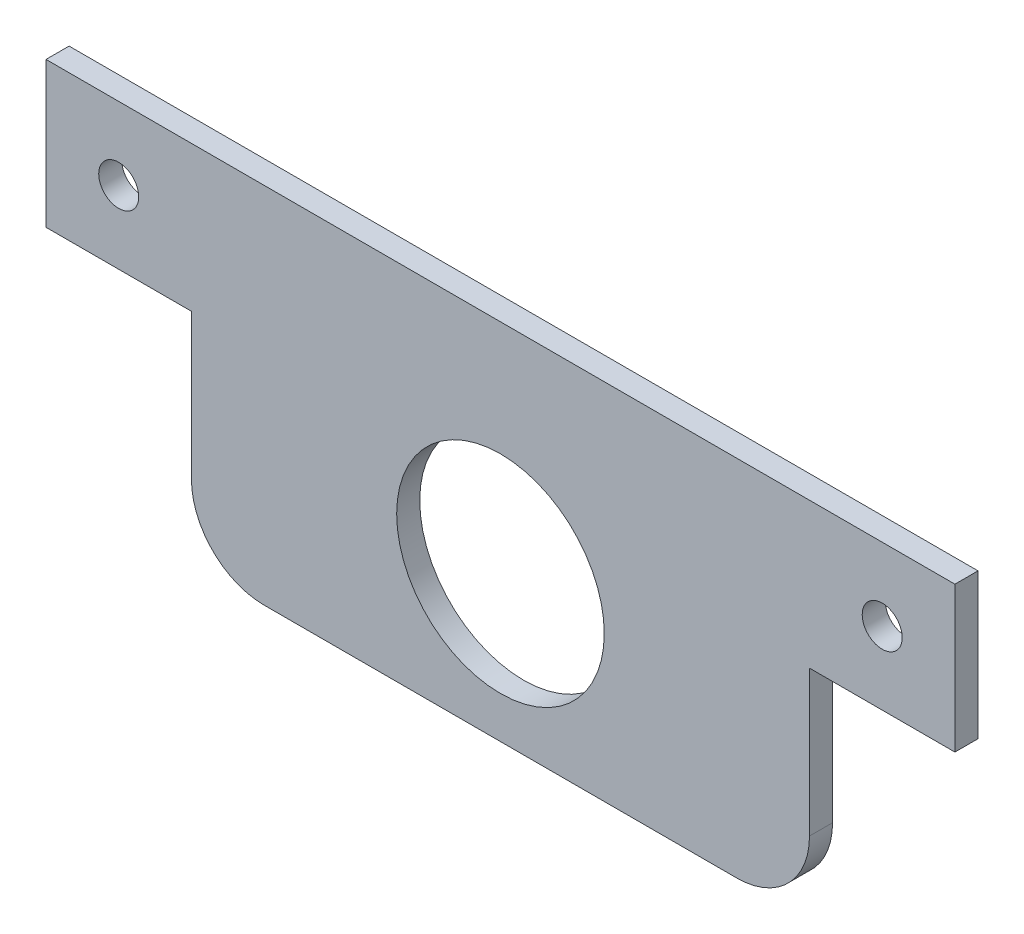
ISO-10303-21;
HEADER;
FILE_DESCRIPTION(('STEP AP214'),'2;1');
FILE_NAME('part.step','',(''),(''),'','','');
FILE_SCHEMA(('AUTOMOTIVE_DESIGN { 1 0 10303 214 1 1 1 1 }'));
ENDSEC;
DATA;
#1=APPLICATION_CONTEXT('core data for automotive mechanical design processes');
#2=APPLICATION_PROTOCOL_DEFINITION('international standard','automotive_design',2000,#1);
#3=PRODUCT_CONTEXT('',#1,'mechanical');
#4=PRODUCT('Part','Part','',(#3));
#5=PRODUCT_RELATED_PRODUCT_CATEGORY('part','',(#4));
#6=PRODUCT_DEFINITION_FORMATION('','',#4);
#7=PRODUCT_DEFINITION_CONTEXT('part definition',#1,'design');
#8=PRODUCT_DEFINITION('design','',#6,#7);
#9=PRODUCT_DEFINITION_SHAPE('','',#8);
#10=(LENGTH_UNIT() NAMED_UNIT(*) SI_UNIT(.MILLI.,.METRE.));
#11=(NAMED_UNIT(*) PLANE_ANGLE_UNIT() SI_UNIT($,.RADIAN.));
#12=(NAMED_UNIT(*) SI_UNIT($,.STERADIAN.) SOLID_ANGLE_UNIT());
#13=UNCERTAINTY_MEASURE_WITH_UNIT(LENGTH_MEASURE(1.E-05),#10,'distance_accuracy_value','');
#14=(GEOMETRIC_REPRESENTATION_CONTEXT(3) GLOBAL_UNCERTAINTY_ASSIGNED_CONTEXT((#13)) GLOBAL_UNIT_ASSIGNED_CONTEXT((#10,
#11,#12)) REPRESENTATION_CONTEXT('',''));
#15=CARTESIAN_POINT('',(0.,0.,0.));
#16=DIRECTION('',(0.,0.,1.));
#17=DIRECTION('',(1.,0.,0.));
#18=AXIS2_PLACEMENT_3D('',#15,#16,#17);
#19=CARTESIAN_POINT('',(0.,0.,3.175));
#20=DIRECTION('',(1.,0.,0.));
#21=DIRECTION('',(0.,0.,-1.));
#22=AXIS2_PLACEMENT_3D('',#19,#20,#21);
#23=PLANE('',#22);
#24=DIRECTION('',(0.,-1.,0.));
#25=VECTOR('',#24,1.);
#26=CARTESIAN_POINT('',(0.,0.,0.));
#27=LINE('',#26,#25);
#28=CARTESIAN_POINT('',(0.,50.,0.));
#29=VERTEX_POINT('',#28);
#30=CARTESIAN_POINT('',(0.,30.,0.));
#31=VERTEX_POINT('',#30);
#32=EDGE_CURVE('E171',#29,#31,#27,.T.);
#33=ORIENTED_EDGE('',*,*,#32,.T.);
#34=DIRECTION('',(0.,0.,-1.));
#35=VECTOR('',#34,1.);
#36=CARTESIAN_POINT('',(0.,30.,3.175));
#37=LINE('',#36,#35);
#38=CARTESIAN_POINT('',(0.,30.,3.175));
#39=VERTEX_POINT('',#38);
#40=EDGE_CURVE('E124',#39,#31,#37,.T.);
#41=ORIENTED_EDGE('',*,*,#40,.F.);
#42=DIRECTION('',(0.,-1.,0.));
#43=VECTOR('',#42,1.);
#44=CARTESIAN_POINT('',(0.,0.,3.175));
#45=LINE('',#44,#43);
#46=CARTESIAN_POINT('',(0.,50.,3.175));
#47=VERTEX_POINT('',#46);
#48=EDGE_CURVE('E174',#47,#39,#45,.T.);
#49=ORIENTED_EDGE('',*,*,#48,.F.);
#50=DIRECTION('',(0.,0.,-1.));
#51=VECTOR('',#50,1.);
#52=CARTESIAN_POINT('',(0.,50.,3.175));
#53=LINE('',#52,#51);
#54=EDGE_CURVE('E184',#47,#29,#53,.T.);
#55=ORIENTED_EDGE('',*,*,#54,.T.);
#56=EDGE_LOOP('',(#33,#41,#49,#55));
#57=FACE_BOUND('',#56,.T.);
#58=ADVANCED_FACE('F39',(#57),#23,.F.);
#59=CARTESIAN_POINT('',(0.,0.,3.175));
#60=DIRECTION('',(0.,1.,0.));
#61=DIRECTION('',(0.,0.,1.));
#62=AXIS2_PLACEMENT_3D('',#59,#60,#61);
#63=PLANE('',#62);
#64=DIRECTION('',(1.,0.,0.));
#65=VECTOR('',#64,1.);
#66=CARTESIAN_POINT('',(0.,0.,3.175));
#67=LINE('',#66,#65);
#68=CARTESIAN_POINT('',(30.,0.,3.175));
#69=VERTEX_POINT('',#68);
#70=CARTESIAN_POINT('',(95.,0.,3.175));
#71=VERTEX_POINT('',#70);
#72=EDGE_CURVE('E177',#69,#71,#67,.T.);
#73=ORIENTED_EDGE('',*,*,#72,.F.);
#74=DIRECTION('',(0.,0.,-1.));
#75=VECTOR('',#74,1.);
#76=CARTESIAN_POINT('',(30.,0.,3.175));
#77=LINE('',#76,#75);
#78=CARTESIAN_POINT('',(30.,0.,0.));
#79=VERTEX_POINT('',#78);
#80=EDGE_CURVE('E199',#69,#79,#77,.T.);
#81=ORIENTED_EDGE('',*,*,#80,.T.);
#82=DIRECTION('',(1.,0.,0.));
#83=VECTOR('',#82,1.);
#84=CARTESIAN_POINT('',(0.,0.,0.));
#85=LINE('',#84,#83);
#86=CARTESIAN_POINT('',(95.,0.,0.));
#87=VERTEX_POINT('',#86);
#88=EDGE_CURVE('E186',#79,#87,#85,.T.);
#89=ORIENTED_EDGE('',*,*,#88,.T.);
#90=DIRECTION('',(0.,0.,-1.));
#91=VECTOR('',#90,1.);
#92=CARTESIAN_POINT('',(95.,0.,3.175));
#93=LINE('',#92,#91);
#94=EDGE_CURVE('E197',#87,#71,#93,.F.);
#95=ORIENTED_EDGE('',*,*,#94,.T.);
#96=EDGE_LOOP('',(#73,#81,#89,#95));
#97=FACE_BOUND('',#96,.T.);
#98=ADVANCED_FACE('F212',(#97),#63,.F.);
#99=CARTESIAN_POINT('',(125.,0.,3.175));
#100=DIRECTION('',(-1.,0.,0.));
#101=DIRECTION('',(0.,0.,1.));
#102=AXIS2_PLACEMENT_3D('',#99,#100,#101);
#103=PLANE('',#102);
#104=DIRECTION('',(0.,1.,0.));
#105=VECTOR('',#104,1.);
#106=CARTESIAN_POINT('',(125.,0.,3.175));
#107=LINE('',#106,#105);
#108=CARTESIAN_POINT('',(125.,30.,3.175));
#109=VERTEX_POINT('',#108);
#110=CARTESIAN_POINT('',(125.,50.,3.175));
#111=VERTEX_POINT('',#110);
#112=EDGE_CURVE('E180',#109,#111,#107,.T.);
#113=ORIENTED_EDGE('',*,*,#112,.F.);
#114=DIRECTION('',(0.,0.,-1.));
#115=VECTOR('',#114,1.);
#116=CARTESIAN_POINT('',(125.,30.,3.175));
#117=LINE('',#116,#115);
#118=CARTESIAN_POINT('',(125.,30.,0.));
#119=VERTEX_POINT('',#118);
#120=EDGE_CURVE('E150',#109,#119,#117,.T.);
#121=ORIENTED_EDGE('',*,*,#120,.T.);
#122=DIRECTION('',(0.,1.,0.));
#123=VECTOR('',#122,1.);
#124=CARTESIAN_POINT('',(125.,0.,0.));
#125=LINE('',#124,#123);
#126=CARTESIAN_POINT('',(125.,50.,0.));
#127=VERTEX_POINT('',#126);
#128=EDGE_CURVE('E189',#119,#127,#125,.T.);
#129=ORIENTED_EDGE('',*,*,#128,.T.);
#130=DIRECTION('',(0.,0.,-1.));
#131=VECTOR('',#130,1.);
#132=CARTESIAN_POINT('',(125.,50.,3.175));
#133=LINE('',#132,#131);
#134=EDGE_CURVE('E194',#111,#127,#133,.T.);
#135=ORIENTED_EDGE('',*,*,#134,.F.);
#136=EDGE_LOOP('',(#113,#121,#129,#135));
#137=FACE_BOUND('',#136,.T.);
#138=ADVANCED_FACE('F233',(#137),#103,.F.);
#139=CARTESIAN_POINT('',(0.,50.,3.175));
#140=DIRECTION('',(0.,-1.,0.));
#141=DIRECTION('',(0.,0.,-1.));
#142=AXIS2_PLACEMENT_3D('',#139,#140,#141);
#143=PLANE('',#142);
#144=DIRECTION('',(-1.,0.,0.));
#145=VECTOR('',#144,1.);
#146=CARTESIAN_POINT('',(0.,50.,0.));
#147=LINE('',#146,#145);
#148=EDGE_CURVE('E178',#127,#29,#147,.T.);
#149=ORIENTED_EDGE('',*,*,#148,.T.);
#150=ORIENTED_EDGE('',*,*,#54,.F.);
#151=DIRECTION('',(-1.,0.,0.));
#152=VECTOR('',#151,1.);
#153=CARTESIAN_POINT('',(0.,50.,3.175));
#154=LINE('',#153,#152);
#155=EDGE_CURVE('E182',#111,#47,#154,.T.);
#156=ORIENTED_EDGE('',*,*,#155,.F.);
#157=ORIENTED_EDGE('',*,*,#134,.T.);
#158=EDGE_LOOP('',(#149,#150,#156,#157));
#159=FACE_BOUND('',#158,.T.);
#160=ADVANCED_FACE('F237',(#159),#143,.F.);
#161=CARTESIAN_POINT('',(0.,0.,3.175));
#162=DIRECTION('',(0.,0.,-1.));
#163=DIRECTION('',(-1.,0.,0.));
#164=AXIS2_PLACEMENT_3D('',#161,#162,#163);
#165=PLANE('',#164);
#166=CARTESIAN_POINT('',(10.,40.,3.175));
#167=DIRECTION('',(0.,0.,-1.));
#168=DIRECTION('',(-1.,0.,0.));
#169=AXIS2_PLACEMENT_3D('',#166,#167,#168);
#170=CIRCLE('',#169,2.75);
#171=CARTESIAN_POINT('',(7.25,40.,3.175));
#172=VERTEX_POINT('',#171);
#173=EDGE_CURVE('E134',#172,#172,#170,.T.);
#174=ORIENTED_EDGE('',*,*,#173,.T.);
#175=EDGE_LOOP('',(#174));
#176=FACE_BOUND('',#175,.T.);
#177=CARTESIAN_POINT('',(115.,40.,3.175));
#178=DIRECTION('',(0.,0.,-1.));
#179=DIRECTION('',(-1.,0.,0.));
#180=AXIS2_PLACEMENT_3D('',#177,#178,#179);
#181=CIRCLE('',#180,2.75000000000001);
#182=CARTESIAN_POINT('',(112.25,40.,3.175));
#183=VERTEX_POINT('',#182);
#184=EDGE_CURVE('E160',#183,#183,#181,.T.);
#185=ORIENTED_EDGE('',*,*,#184,.T.);
#186=EDGE_LOOP('',(#185));
#187=FACE_BOUND('',#186,.T.);
#188=CARTESIAN_POINT('',(62.5,20.,3.175));
#189=DIRECTION('',(0.,0.,1.));
#190=DIRECTION('',(1.,0.,0.));
#191=AXIS2_PLACEMENT_3D('',#188,#189,#190);
#192=CIRCLE('',#191,14.275);
#193=CARTESIAN_POINT('',(76.775,20.,3.175));
#194=VERTEX_POINT('',#193);
#195=EDGE_CURVE('E163',#194,#194,#192,.T.);
#196=ORIENTED_EDGE('',*,*,#195,.F.);
#197=EDGE_LOOP('',(#196));
#198=FACE_BOUND('',#197,.T.);
#199=DIRECTION('',(0.,-1.,0.));
#200=VECTOR('',#199,1.);
#201=CARTESIAN_POINT('',(20.,0.,3.175));
#202=LINE('',#201,#200);
#203=CARTESIAN_POINT('',(20.,30.,3.175));
#204=VERTEX_POINT('',#203);
#205=CARTESIAN_POINT('',(20.,10.,3.175));
#206=VERTEX_POINT('',#205);
#207=EDGE_CURVE('E121',#204,#206,#202,.T.);
#208=ORIENTED_EDGE('',*,*,#207,.T.);
#209=CARTESIAN_POINT('',(30.,10.,3.175));
#210=DIRECTION('',(0.,0.,-1.));
#211=DIRECTION('',(-1.,0.,0.));
#212=AXIS2_PLACEMENT_3D('',#209,#210,#211);
#213=CIRCLE('',#212,10.);
#214=EDGE_CURVE('E47',#206,#69,#213,.F.);
#215=ORIENTED_EDGE('',*,*,#214,.T.);
#216=ORIENTED_EDGE('',*,*,#72,.T.);
#217=CARTESIAN_POINT('',(95.,10.,3.175));
#218=DIRECTION('',(0.,0.,-1.));
#219=DIRECTION('',(-1.,0.,0.));
#220=AXIS2_PLACEMENT_3D('',#217,#218,#219);
#221=CIRCLE('',#220,10.);
#222=CARTESIAN_POINT('',(105.,10.,3.175));
#223=VERTEX_POINT('',#222);
#224=EDGE_CURVE('E54',#71,#223,#221,.F.);
#225=ORIENTED_EDGE('',*,*,#224,.T.);
#226=DIRECTION('',(0.,1.,0.));
#227=VECTOR('',#226,1.);
#228=CARTESIAN_POINT('',(105.,0.,3.175));
#229=LINE('',#228,#227);
#230=CARTESIAN_POINT('',(105.,30.,3.175));
#231=VERTEX_POINT('',#230);
#232=EDGE_CURVE('E155',#223,#231,#229,.T.);
#233=ORIENTED_EDGE('',*,*,#232,.T.);
#234=DIRECTION('',(1.,0.,0.));
#235=VECTOR('',#234,1.);
#236=CARTESIAN_POINT('',(125.,30.,3.175));
#237=LINE('',#236,#235);
#238=EDGE_CURVE('E149',#231,#109,#237,.T.);
#239=ORIENTED_EDGE('',*,*,#238,.T.);
#240=ORIENTED_EDGE('',*,*,#112,.T.);
#241=ORIENTED_EDGE('',*,*,#155,.T.);
#242=ORIENTED_EDGE('',*,*,#48,.T.);
#243=DIRECTION('',(1.,0.,0.));
#244=VECTOR('',#243,1.);
#245=CARTESIAN_POINT('',(0.,30.,3.175));
#246=LINE('',#245,#244);
#247=EDGE_CURVE('E140',#39,#204,#246,.T.);
#248=ORIENTED_EDGE('',*,*,#247,.T.);
#249=EDGE_LOOP('',(#208,#215,#216,#225,#233,#239,#240,#241,#242,#248));
#250=FACE_BOUND('',#249,.T.);
#251=ADVANCED_FACE('F208',(#176,#187,#198,#250),#165,.F.);
#252=CARTESIAN_POINT('',(0.,0.,0.));
#253=DIRECTION('',(0.,0.,-1.));
#254=DIRECTION('',(-1.,0.,0.));
#255=AXIS2_PLACEMENT_3D('',#252,#253,#254);
#256=PLANE('',#255);
#257=ORIENTED_EDGE('',*,*,#88,.F.);
#258=CARTESIAN_POINT('',(30.,10.,0.));
#259=DIRECTION('',(0.,0.,-1.));
#260=DIRECTION('',(-1.,0.,0.));
#261=AXIS2_PLACEMENT_3D('',#258,#259,#260);
#262=CIRCLE('',#261,10.);
#263=CARTESIAN_POINT('',(20.,10.,0.));
#264=VERTEX_POINT('',#263);
#265=EDGE_CURVE('E139',#79,#264,#262,.T.);
#266=ORIENTED_EDGE('',*,*,#265,.T.);
#267=DIRECTION('',(0.,-1.,0.));
#268=VECTOR('',#267,1.);
#269=CARTESIAN_POINT('',(20.,0.,0.));
#270=LINE('',#269,#268);
#271=CARTESIAN_POINT('',(20.,30.,0.));
#272=VERTEX_POINT('',#271);
#273=EDGE_CURVE('E120',#272,#264,#270,.T.);
#274=ORIENTED_EDGE('',*,*,#273,.F.);
#275=DIRECTION('',(1.,0.,0.));
#276=VECTOR('',#275,1.);
#277=CARTESIAN_POINT('',(0.,30.,0.));
#278=LINE('',#277,#276);
#279=EDGE_CURVE('E128',#31,#272,#278,.T.);
#280=ORIENTED_EDGE('',*,*,#279,.F.);
#281=ORIENTED_EDGE('',*,*,#32,.F.);
#282=ORIENTED_EDGE('',*,*,#148,.F.);
#283=ORIENTED_EDGE('',*,*,#128,.F.);
#284=DIRECTION('',(1.,0.,0.));
#285=VECTOR('',#284,1.);
#286=CARTESIAN_POINT('',(125.,30.,0.));
#287=LINE('',#286,#285);
#288=CARTESIAN_POINT('',(105.,30.,0.));
#289=VERTEX_POINT('',#288);
#290=EDGE_CURVE('E153',#289,#119,#287,.T.);
#291=ORIENTED_EDGE('',*,*,#290,.F.);
#292=DIRECTION('',(0.,1.,0.));
#293=VECTOR('',#292,1.);
#294=CARTESIAN_POINT('',(105.,0.,0.));
#295=LINE('',#294,#293);
#296=CARTESIAN_POINT('',(105.,10.,0.));
#297=VERTEX_POINT('',#296);
#298=EDGE_CURVE('E125',#297,#289,#295,.T.);
#299=ORIENTED_EDGE('',*,*,#298,.F.);
#300=CARTESIAN_POINT('',(95.,10.,0.));
#301=DIRECTION('',(0.,0.,-1.));
#302=DIRECTION('',(-1.,0.,0.));
#303=AXIS2_PLACEMENT_3D('',#300,#301,#302);
#304=CIRCLE('',#303,10.);
#305=EDGE_CURVE('E202',#297,#87,#304,.T.);
#306=ORIENTED_EDGE('',*,*,#305,.T.);
#307=EDGE_LOOP('',(#257,#266,#274,#280,#281,#282,#283,#291,#299,#306));
#308=FACE_BOUND('',#307,.T.);
#309=CARTESIAN_POINT('',(10.,40.,0.));
#310=DIRECTION('',(0.,0.,-1.));
#311=DIRECTION('',(-1.,0.,0.));
#312=AXIS2_PLACEMENT_3D('',#309,#310,#311);
#313=CIRCLE('',#312,2.75);
#314=CARTESIAN_POINT('',(7.25,40.,0.));
#315=VERTEX_POINT('',#314);
#316=EDGE_CURVE('E167',#315,#315,#313,.T.);
#317=ORIENTED_EDGE('',*,*,#316,.F.);
#318=EDGE_LOOP('',(#317));
#319=FACE_BOUND('',#318,.T.);
#320=CARTESIAN_POINT('',(115.,40.,0.));
#321=DIRECTION('',(0.,0.,-1.));
#322=DIRECTION('',(-1.,0.,0.));
#323=AXIS2_PLACEMENT_3D('',#320,#321,#322);
#324=CIRCLE('',#323,2.75000000000001);
#325=CARTESIAN_POINT('',(112.25,40.,0.));
#326=VERTEX_POINT('',#325);
#327=EDGE_CURVE('E164',#326,#326,#324,.T.);
#328=ORIENTED_EDGE('',*,*,#327,.F.);
#329=EDGE_LOOP('',(#328));
#330=FACE_BOUND('',#329,.T.);
#331=CARTESIAN_POINT('',(62.5,20.,0.));
#332=DIRECTION('',(0.,0.,1.));
#333=DIRECTION('',(1.,0.,0.));
#334=AXIS2_PLACEMENT_3D('',#331,#332,#333);
#335=CIRCLE('',#334,14.275);
#336=CARTESIAN_POINT('',(76.775,20.,0.));
#337=VERTEX_POINT('',#336);
#338=EDGE_CURVE('E168',#337,#337,#335,.T.);
#339=ORIENTED_EDGE('',*,*,#338,.T.);
#340=EDGE_LOOP('',(#339));
#341=FACE_BOUND('',#340,.T.);
#342=ADVANCED_FACE('F137',(#308,#319,#330,#341),#256,.T.);
#343=CARTESIAN_POINT('',(62.5,20.,0.));
#344=DIRECTION('',(0.,0.,1.));
#345=DIRECTION('',(1.,0.,0.));
#346=AXIS2_PLACEMENT_3D('',#343,#344,#345);
#347=CYLINDRICAL_SURFACE('',#346,14.275);
#348=ORIENTED_EDGE('',*,*,#338,.F.);
#349=EDGE_LOOP('',(#348));
#350=FACE_BOUND('',#349,.T.);
#351=ORIENTED_EDGE('',*,*,#195,.T.);
#352=EDGE_LOOP('',(#351));
#353=FACE_BOUND('',#352,.T.);
#354=ADVANCED_FACE('F244',(#350,#353),#347,.F.);
#355=CARTESIAN_POINT('',(115.,40.,3.175));
#356=DIRECTION('',(0.,0.,-1.));
#357=DIRECTION('',(-1.,0.,0.));
#358=AXIS2_PLACEMENT_3D('',#355,#356,#357);
#359=CYLINDRICAL_SURFACE('',#358,2.75000000000001);
#360=ORIENTED_EDGE('',*,*,#184,.F.);
#361=EDGE_LOOP('',(#360));
#362=FACE_BOUND('',#361,.T.);
#363=ORIENTED_EDGE('',*,*,#327,.T.);
#364=EDGE_LOOP('',(#363));
#365=FACE_BOUND('',#364,.T.);
#366=ADVANCED_FACE('F249',(#362,#365),#359,.F.);
#367=CARTESIAN_POINT('',(10.,40.,3.175));
#368=DIRECTION('',(0.,0.,-1.));
#369=DIRECTION('',(-1.,0.,0.));
#370=AXIS2_PLACEMENT_3D('',#367,#368,#369);
#371=CYLINDRICAL_SURFACE('',#370,2.75);
#372=ORIENTED_EDGE('',*,*,#173,.F.);
#373=EDGE_LOOP('',(#372));
#374=FACE_BOUND('',#373,.T.);
#375=ORIENTED_EDGE('',*,*,#316,.T.);
#376=EDGE_LOOP('',(#375));
#377=FACE_BOUND('',#376,.T.);
#378=ADVANCED_FACE('F253',(#374,#377),#371,.F.);
#379=CARTESIAN_POINT('',(20.,0.,3.175));
#380=DIRECTION('',(1.,0.,0.));
#381=DIRECTION('',(0.,0.,-1.));
#382=AXIS2_PLACEMENT_3D('',#379,#380,#381);
#383=PLANE('',#382);
#384=ORIENTED_EDGE('',*,*,#273,.T.);
#385=DIRECTION('',(0.,0.,-1.));
#386=VECTOR('',#385,1.);
#387=CARTESIAN_POINT('',(20.,10.,3.175));
#388=LINE('',#387,#386);
#389=EDGE_CURVE('E62',#264,#206,#388,.F.);
#390=ORIENTED_EDGE('',*,*,#389,.T.);
#391=ORIENTED_EDGE('',*,*,#207,.F.);
#392=DIRECTION('',(0.,0.,-1.));
#393=VECTOR('',#392,1.);
#394=CARTESIAN_POINT('',(20.,30.,3.175));
#395=LINE('',#394,#393);
#396=EDGE_CURVE('E116',#204,#272,#395,.T.);
#397=ORIENTED_EDGE('',*,*,#396,.T.);
#398=EDGE_LOOP('',(#384,#390,#391,#397));
#399=FACE_BOUND('',#398,.T.);
#400=ADVANCED_FACE('F118',(#399),#383,.F.);
#401=CARTESIAN_POINT('',(0.,30.,3.175));
#402=DIRECTION('',(0.,1.,0.));
#403=DIRECTION('',(-1.,0.,0.));
#404=AXIS2_PLACEMENT_3D('',#401,#402,#403);
#405=PLANE('',#404);
#406=ORIENTED_EDGE('',*,*,#279,.T.);
#407=ORIENTED_EDGE('',*,*,#396,.F.);
#408=ORIENTED_EDGE('',*,*,#247,.F.);
#409=ORIENTED_EDGE('',*,*,#40,.T.);
#410=EDGE_LOOP('',(#406,#407,#408,#409));
#411=FACE_BOUND('',#410,.T.);
#412=ADVANCED_FACE('F129',(#411),#405,.F.);
#413=CARTESIAN_POINT('',(125.,30.,3.175));
#414=DIRECTION('',(0.,1.,0.));
#415=DIRECTION('',(0.,0.,1.));
#416=AXIS2_PLACEMENT_3D('',#413,#414,#415);
#417=PLANE('',#416);
#418=ORIENTED_EDGE('',*,*,#290,.T.);
#419=ORIENTED_EDGE('',*,*,#120,.F.);
#420=ORIENTED_EDGE('',*,*,#238,.F.);
#421=DIRECTION('',(0.,0.,-1.));
#422=VECTOR('',#421,1.);
#423=CARTESIAN_POINT('',(105.,30.,3.175));
#424=LINE('',#423,#422);
#425=EDGE_CURVE('E146',#231,#289,#424,.T.);
#426=ORIENTED_EDGE('',*,*,#425,.T.);
#427=EDGE_LOOP('',(#418,#419,#420,#426));
#428=FACE_BOUND('',#427,.T.);
#429=ADVANCED_FACE('F222',(#428),#417,.F.);
#430=CARTESIAN_POINT('',(105.,0.,3.175));
#431=DIRECTION('',(-1.,0.,0.));
#432=DIRECTION('',(0.,0.,1.));
#433=AXIS2_PLACEMENT_3D('',#430,#431,#432);
#434=PLANE('',#433);
#435=ORIENTED_EDGE('',*,*,#232,.F.);
#436=DIRECTION('',(0.,0.,-1.));
#437=VECTOR('',#436,1.);
#438=CARTESIAN_POINT('',(105.,10.,3.175));
#439=LINE('',#438,#437);
#440=EDGE_CURVE('E11',#223,#297,#439,.T.);
#441=ORIENTED_EDGE('',*,*,#440,.T.);
#442=ORIENTED_EDGE('',*,*,#298,.T.);
#443=ORIENTED_EDGE('',*,*,#425,.F.);
#444=EDGE_LOOP('',(#435,#441,#442,#443));
#445=FACE_BOUND('',#444,.T.);
#446=ADVANCED_FACE('F216',(#445),#434,.F.);
#447=CARTESIAN_POINT('',(30.,10.,3.175));
#448=DIRECTION('',(0.,0.,-1.));
#449=DIRECTION('',(-1.,0.,0.));
#450=AXIS2_PLACEMENT_3D('',#447,#448,#449);
#451=CYLINDRICAL_SURFACE('',#450,10.);
#452=ORIENTED_EDGE('',*,*,#214,.F.);
#453=ORIENTED_EDGE('',*,*,#389,.F.);
#454=ORIENTED_EDGE('',*,*,#265,.F.);
#455=ORIENTED_EDGE('',*,*,#80,.F.);
#456=EDGE_LOOP('',(#452,#453,#454,#455));
#457=FACE_BOUND('',#456,.T.);
#458=ADVANCED_FACE('F214',(#457),#451,.T.);
#459=CARTESIAN_POINT('',(95.,10.,3.175));
#460=DIRECTION('',(0.,0.,-1.));
#461=DIRECTION('',(-1.,0.,0.));
#462=AXIS2_PLACEMENT_3D('',#459,#460,#461);
#463=CYLINDRICAL_SURFACE('',#462,10.);
#464=ORIENTED_EDGE('',*,*,#224,.F.);
#465=ORIENTED_EDGE('',*,*,#94,.F.);
#466=ORIENTED_EDGE('',*,*,#305,.F.);
#467=ORIENTED_EDGE('',*,*,#440,.F.);
#468=EDGE_LOOP('',(#464,#465,#466,#467));
#469=FACE_BOUND('',#468,.T.);
#470=ADVANCED_FACE('F41',(#469),#463,.T.);
#471=CLOSED_SHELL('',(#58,#98,#138,#160,#251,#342,#354,#366,#378,#400,#412,#429,#446,#458,#470));
#472=MANIFOLD_SOLID_BREP('B2',#471);
#473=ADVANCED_BREP_SHAPE_REPRESENTATION('',(#18,#472),#14);
#474=SHAPE_DEFINITION_REPRESENTATION(#9,#473);
ENDSEC;
END-ISO-10303-21;
